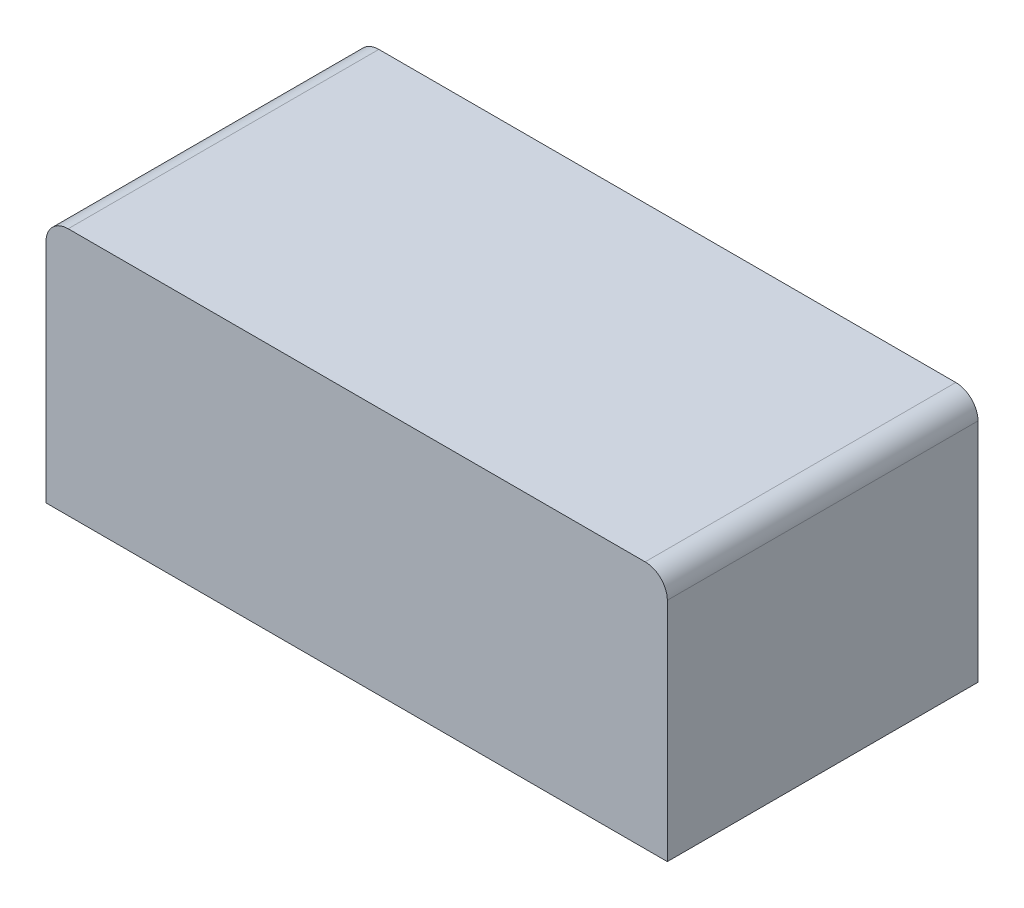
ISO-10303-21;
HEADER;
FILE_DESCRIPTION(('STEP AP214'),'2;1');
FILE_NAME('part.step','',(''),(''),'','','');
FILE_SCHEMA(('AUTOMOTIVE_DESIGN { 1 0 10303 214 1 1 1 1 }'));
ENDSEC;
DATA;
#1=APPLICATION_CONTEXT('core data for automotive mechanical design processes');
#2=APPLICATION_PROTOCOL_DEFINITION('international standard','automotive_design',2000,#1);
#3=PRODUCT_CONTEXT('',#1,'mechanical');
#4=PRODUCT('Part','Part','',(#3));
#5=PRODUCT_RELATED_PRODUCT_CATEGORY('part','',(#4));
#6=PRODUCT_DEFINITION_FORMATION('','',#4);
#7=PRODUCT_DEFINITION_CONTEXT('part definition',#1,'design');
#8=PRODUCT_DEFINITION('design','',#6,#7);
#9=PRODUCT_DEFINITION_SHAPE('','',#8);
#10=(LENGTH_UNIT() NAMED_UNIT(*) SI_UNIT(.MILLI.,.METRE.));
#11=(NAMED_UNIT(*) PLANE_ANGLE_UNIT() SI_UNIT($,.RADIAN.));
#12=(NAMED_UNIT(*) SI_UNIT($,.STERADIAN.) SOLID_ANGLE_UNIT());
#13=UNCERTAINTY_MEASURE_WITH_UNIT(LENGTH_MEASURE(1.E-05),#10,'distance_accuracy_value','');
#14=(GEOMETRIC_REPRESENTATION_CONTEXT(3) GLOBAL_UNCERTAINTY_ASSIGNED_CONTEXT((#13)) GLOBAL_UNIT_ASSIGNED_CONTEXT((#10,
#11,#12)) REPRESENTATION_CONTEXT('',''));
#15=CARTESIAN_POINT('',(0.,0.,0.));
#16=DIRECTION('',(0.,0.,1.));
#17=DIRECTION('',(1.,0.,0.));
#18=AXIS2_PLACEMENT_3D('',#15,#16,#17);
#19=CARTESIAN_POINT('',(1.39999999999999,1.12,0.699999999999992));
#20=DIRECTION('',(0.,0.,-1.));
#21=DIRECTION('',(-1.,0.,0.));
#22=AXIS2_PLACEMENT_3D('',#19,#20,#21);
#23=PLANE('',#22);
#24=DIRECTION('',(0.,-1.,0.));
#25=VECTOR('',#24,1.);
#26=CARTESIAN_POINT('',(1.39999999999999,1.12,0.699999999999992));
#27=LINE('',#26,#25);
#28=CARTESIAN_POINT('',(1.39999999999999,1.02,0.699999999999992));
#29=VERTEX_POINT('',#28);
#30=CARTESIAN_POINT('',(1.39999999999999,0.,0.699999999999992));
#31=VERTEX_POINT('',#30);
#32=EDGE_CURVE('E85',#29,#31,#27,.T.);
#33=ORIENTED_EDGE('',*,*,#32,.F.);
#34=CARTESIAN_POINT('',(1.29999999999999,1.02,0.699999999999993));
#35=DIRECTION('',(0.,0.,-1.));
#36=DIRECTION('',(-1.,0.,0.));
#37=AXIS2_PLACEMENT_3D('',#34,#35,#36);
#38=CIRCLE('',#37,0.1);
#39=CARTESIAN_POINT('',(1.29999999999999,1.12,0.699999999999993));
#40=VERTEX_POINT('',#39);
#41=EDGE_CURVE('E42',#29,#40,#38,.F.);
#42=ORIENTED_EDGE('',*,*,#41,.T.);
#43=DIRECTION('',(1.,0.,0.));
#44=VECTOR('',#43,1.);
#45=CARTESIAN_POINT('',(1.39999999999999,1.12,0.699999999999992));
#46=LINE('',#45,#44);
#47=CARTESIAN_POINT('',(-1.30000000000001,1.12,0.699999999999999));
#48=VERTEX_POINT('',#47);
#49=EDGE_CURVE('E113',#48,#40,#46,.T.);
#50=ORIENTED_EDGE('',*,*,#49,.F.);
#51=CARTESIAN_POINT('',(-1.30000000000001,1.02,0.699999999999999));
#52=DIRECTION('',(0.,0.,-1.));
#53=DIRECTION('',(-1.,0.,0.));
#54=AXIS2_PLACEMENT_3D('',#51,#52,#53);
#55=CIRCLE('',#54,0.1);
#56=CARTESIAN_POINT('',(-1.40000000000001,1.02,0.699999999999999));
#57=VERTEX_POINT('',#56);
#58=EDGE_CURVE('E49',#48,#57,#55,.F.);
#59=ORIENTED_EDGE('',*,*,#58,.T.);
#60=DIRECTION('',(0.,-1.,0.));
#61=VECTOR('',#60,1.);
#62=CARTESIAN_POINT('',(-1.40000000000001,1.12,0.699999999999999));
#63=LINE('',#62,#61);
#64=CARTESIAN_POINT('',(-1.40000000000001,0.,0.699999999999999));
#65=VERTEX_POINT('',#64);
#66=EDGE_CURVE('E103',#57,#65,#63,.T.);
#67=ORIENTED_EDGE('',*,*,#66,.T.);
#68=DIRECTION('',(1.,0.,0.));
#69=VECTOR('',#68,1.);
#70=CARTESIAN_POINT('',(1.39999999999999,0.,0.699999999999992));
#71=LINE('',#70,#69);
#72=EDGE_CURVE('E99',#65,#31,#71,.T.);
#73=ORIENTED_EDGE('',*,*,#72,.T.);
#74=EDGE_LOOP('',(#33,#42,#50,#59,#67,#73));
#75=FACE_BOUND('',#74,.T.);
#76=ADVANCED_FACE('F34',(#75),#23,.F.);
#77=CARTESIAN_POINT('',(1.39999999999999,1.12,0.699999999999992));
#78=DIRECTION('',(-1.,0.,0.));
#79=DIRECTION('',(0.,0.,1.));
#80=AXIS2_PLACEMENT_3D('',#77,#78,#79);
#81=PLANE('',#80);
#82=DIRECTION('',(0.,-1.,0.));
#83=VECTOR('',#82,1.);
#84=CARTESIAN_POINT('',(1.39999999999999,1.12,-0.699999999999992));
#85=LINE('',#84,#83);
#86=CARTESIAN_POINT('',(1.39999999999999,1.02,-0.699999999999992));
#87=VERTEX_POINT('',#86);
#88=CARTESIAN_POINT('',(1.39999999999999,0.,-0.699999999999992));
#89=VERTEX_POINT('',#88);
#90=EDGE_CURVE('E93',#87,#89,#85,.T.);
#91=ORIENTED_EDGE('',*,*,#90,.F.);
#92=DIRECTION('',(0.,0.,-1.));
#93=VECTOR('',#92,1.);
#94=CARTESIAN_POINT('',(1.39999999999999,1.02,0.699999999999992));
#95=LINE('',#94,#93);
#96=EDGE_CURVE('E57',#87,#29,#95,.F.);
#97=ORIENTED_EDGE('',*,*,#96,.T.);
#98=ORIENTED_EDGE('',*,*,#32,.T.);
#99=DIRECTION('',(0.,0.,-1.));
#100=VECTOR('',#99,1.);
#101=CARTESIAN_POINT('',(1.39999999999999,0.,0.699999999999992));
#102=LINE('',#101,#100);
#103=EDGE_CURVE('E88',#31,#89,#102,.T.);
#104=ORIENTED_EDGE('',*,*,#103,.T.);
#105=EDGE_LOOP('',(#91,#97,#98,#104));
#106=FACE_BOUND('',#105,.T.);
#107=ADVANCED_FACE('F87',(#106),#81,.F.);
#108=CARTESIAN_POINT('',(1.39999999999999,1.12,-0.699999999999992));
#109=DIRECTION('',(0.,0.,1.));
#110=DIRECTION('',(1.,0.,0.));
#111=AXIS2_PLACEMENT_3D('',#108,#109,#110);
#112=PLANE('',#111);
#113=DIRECTION('',(-1.,0.,0.));
#114=VECTOR('',#113,1.);
#115=CARTESIAN_POINT('',(1.39999999999999,1.12,-0.699999999999992));
#116=LINE('',#115,#114);
#117=CARTESIAN_POINT('',(1.29999999999999,1.12,-0.699999999999993));
#118=VERTEX_POINT('',#117);
#119=CARTESIAN_POINT('',(-1.30000000000001,1.12,-0.699999999999999));
#120=VERTEX_POINT('',#119);
#121=EDGE_CURVE('E107',#118,#120,#116,.T.);
#122=ORIENTED_EDGE('',*,*,#121,.F.);
#123=CARTESIAN_POINT('',(1.29999999999999,1.02,-0.699999999999993));
#124=DIRECTION('',(0.,0.,1.));
#125=DIRECTION('',(1.,0.,0.));
#126=AXIS2_PLACEMENT_3D('',#123,#124,#125);
#127=CIRCLE('',#126,0.1);
#128=EDGE_CURVE('E125',#118,#87,#127,.F.);
#129=ORIENTED_EDGE('',*,*,#128,.T.);
#130=ORIENTED_EDGE('',*,*,#90,.T.);
#131=DIRECTION('',(-1.,0.,0.));
#132=VECTOR('',#131,1.);
#133=CARTESIAN_POINT('',(1.39999999999999,0.,-0.699999999999992));
#134=LINE('',#133,#132);
#135=CARTESIAN_POINT('',(-1.40000000000001,0.,-0.699999999999999));
#136=VERTEX_POINT('',#135);
#137=EDGE_CURVE('E101',#89,#136,#134,.T.);
#138=ORIENTED_EDGE('',*,*,#137,.T.);
#139=DIRECTION('',(0.,-1.,0.));
#140=VECTOR('',#139,1.);
#141=CARTESIAN_POINT('',(-1.40000000000001,1.12,-0.699999999999999));
#142=LINE('',#141,#140);
#143=CARTESIAN_POINT('',(-1.40000000000001,1.02,-0.699999999999999));
#144=VERTEX_POINT('',#143);
#145=EDGE_CURVE('E115',#144,#136,#142,.T.);
#146=ORIENTED_EDGE('',*,*,#145,.F.);
#147=CARTESIAN_POINT('',(-1.30000000000001,1.02,-0.699999999999999));
#148=DIRECTION('',(0.,0.,1.));
#149=DIRECTION('',(1.,0.,0.));
#150=AXIS2_PLACEMENT_3D('',#147,#148,#149);
#151=CIRCLE('',#150,0.1);
#152=EDGE_CURVE('E123',#144,#120,#151,.F.);
#153=ORIENTED_EDGE('',*,*,#152,.T.);
#154=EDGE_LOOP('',(#122,#129,#130,#138,#146,#153));
#155=FACE_BOUND('',#154,.T.);
#156=ADVANCED_FACE('F138',(#155),#112,.F.);
#157=CARTESIAN_POINT('',(-1.40000000000001,1.12,0.699999999999999));
#158=DIRECTION('',(1.,0.,0.));
#159=DIRECTION('',(0.,0.,-1.));
#160=AXIS2_PLACEMENT_3D('',#157,#158,#159);
#161=PLANE('',#160);
#162=ORIENTED_EDGE('',*,*,#66,.F.);
#163=DIRECTION('',(0.,0.,1.));
#164=VECTOR('',#163,1.);
#165=CARTESIAN_POINT('',(-1.40000000000001,1.02,0.699999999999999));
#166=LINE('',#165,#164);
#167=EDGE_CURVE('E11',#57,#144,#166,.F.);
#168=ORIENTED_EDGE('',*,*,#167,.T.);
#169=ORIENTED_EDGE('',*,*,#145,.T.);
#170=DIRECTION('',(0.,0.,1.));
#171=VECTOR('',#170,1.);
#172=CARTESIAN_POINT('',(-1.40000000000001,0.,0.699999999999999));
#173=LINE('',#172,#171);
#174=EDGE_CURVE('E111',#136,#65,#173,.T.);
#175=ORIENTED_EDGE('',*,*,#174,.T.);
#176=EDGE_LOOP('',(#162,#168,#169,#175));
#177=FACE_BOUND('',#176,.T.);
#178=ADVANCED_FACE('F144',(#177),#161,.F.);
#179=CARTESIAN_POINT('',(-1.40000000000001,1.12,0.699999999999999));
#180=DIRECTION('',(0.,-1.,0.));
#181=DIRECTION('',(0.,0.,-1.));
#182=AXIS2_PLACEMENT_3D('',#179,#180,#181);
#183=PLANE('',#182);
#184=ORIENTED_EDGE('',*,*,#49,.T.);
#185=DIRECTION('',(0.,0.,-1.));
#186=VECTOR('',#185,1.);
#187=CARTESIAN_POINT('',(1.29999999999999,1.12,0.7));
#188=LINE('',#187,#186);
#189=EDGE_CURVE('E120',#40,#118,#188,.T.);
#190=ORIENTED_EDGE('',*,*,#189,.T.);
#191=ORIENTED_EDGE('',*,*,#121,.T.);
#192=DIRECTION('',(0.,0.,1.));
#193=VECTOR('',#192,1.);
#194=CARTESIAN_POINT('',(-1.30000000000001,1.12,0.699999999999999));
#195=LINE('',#194,#193);
#196=EDGE_CURVE('E92',#120,#48,#195,.T.);
#197=ORIENTED_EDGE('',*,*,#196,.T.);
#198=EDGE_LOOP('',(#184,#190,#191,#197));
#199=FACE_BOUND('',#198,.T.);
#200=ADVANCED_FACE('F132',(#199),#183,.F.);
#201=CARTESIAN_POINT('',(-1.40000000000001,0.,0.699999999999999));
#202=DIRECTION('',(0.,-1.,0.));
#203=DIRECTION('',(0.,0.,-1.));
#204=AXIS2_PLACEMENT_3D('',#201,#202,#203);
#205=PLANE('',#204);
#206=ORIENTED_EDGE('',*,*,#72,.F.);
#207=ORIENTED_EDGE('',*,*,#174,.F.);
#208=ORIENTED_EDGE('',*,*,#137,.F.);
#209=ORIENTED_EDGE('',*,*,#103,.F.);
#210=EDGE_LOOP('',(#206,#207,#208,#209));
#211=FACE_BOUND('',#210,.T.);
#212=ADVANCED_FACE('F97',(#211),#205,.T.);
#213=CARTESIAN_POINT('',(1.29999999999999,1.02,0.7));
#214=DIRECTION('',(0.,0.,-1.));
#215=DIRECTION('',(-1.,0.,0.));
#216=AXIS2_PLACEMENT_3D('',#213,#214,#215);
#217=CYLINDRICAL_SURFACE('',#216,0.1);
#218=ORIENTED_EDGE('',*,*,#41,.F.);
#219=ORIENTED_EDGE('',*,*,#96,.F.);
#220=ORIENTED_EDGE('',*,*,#128,.F.);
#221=ORIENTED_EDGE('',*,*,#189,.F.);
#222=EDGE_LOOP('',(#218,#219,#220,#221));
#223=FACE_BOUND('',#222,.T.);
#224=ADVANCED_FACE('F136',(#223),#217,.T.);
#225=CARTESIAN_POINT('',(-1.30000000000001,1.02,0.699999999999999));
#226=DIRECTION('',(0.,0.,1.));
#227=DIRECTION('',(1.,0.,0.));
#228=AXIS2_PLACEMENT_3D('',#225,#226,#227);
#229=CYLINDRICAL_SURFACE('',#228,0.1);
#230=ORIENTED_EDGE('',*,*,#152,.F.);
#231=ORIENTED_EDGE('',*,*,#167,.F.);
#232=ORIENTED_EDGE('',*,*,#58,.F.);
#233=ORIENTED_EDGE('',*,*,#196,.F.);
#234=EDGE_LOOP('',(#230,#231,#232,#233));
#235=FACE_BOUND('',#234,.T.);
#236=ADVANCED_FACE('F36',(#235),#229,.T.);
#237=CLOSED_SHELL('',(#76,#107,#156,#178,#200,#212,#224,#236));
#238=MANIFOLD_SOLID_BREP('B2',#237);
#239=ADVANCED_BREP_SHAPE_REPRESENTATION('',(#18,#238),#14);
#240=SHAPE_DEFINITION_REPRESENTATION(#9,#239);
ENDSEC;
END-ISO-10303-21;
